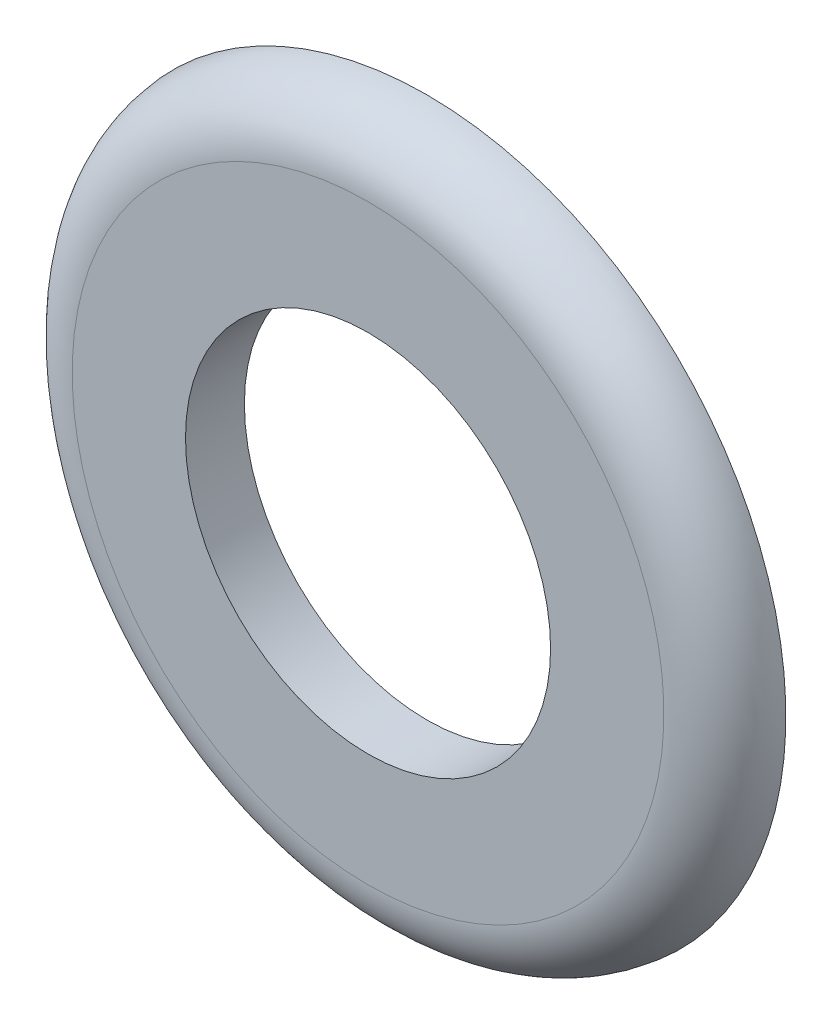
ISO-10303-21;
HEADER;
FILE_DESCRIPTION(('STEP AP214'),'2;1');
FILE_NAME('part.step','',(''),(''),'','','');
FILE_SCHEMA(('AUTOMOTIVE_DESIGN { 1 0 10303 214 1 1 1 1 }'));
ENDSEC;
DATA;
#1=APPLICATION_CONTEXT('core data for automotive mechanical design processes');
#2=APPLICATION_PROTOCOL_DEFINITION('international standard','automotive_design',2000,#1);
#3=PRODUCT_CONTEXT('',#1,'mechanical');
#4=PRODUCT('Part','Part','',(#3));
#5=PRODUCT_RELATED_PRODUCT_CATEGORY('part','',(#4));
#6=PRODUCT_DEFINITION_FORMATION('','',#4);
#7=PRODUCT_DEFINITION_CONTEXT('part definition',#1,'design');
#8=PRODUCT_DEFINITION('design','',#6,#7);
#9=PRODUCT_DEFINITION_SHAPE('','',#8);
#10=(LENGTH_UNIT() NAMED_UNIT(*) SI_UNIT(.MILLI.,.METRE.));
#11=(NAMED_UNIT(*) PLANE_ANGLE_UNIT() SI_UNIT($,.RADIAN.));
#12=(NAMED_UNIT(*) SI_UNIT($,.STERADIAN.) SOLID_ANGLE_UNIT());
#13=UNCERTAINTY_MEASURE_WITH_UNIT(LENGTH_MEASURE(1.E-05),#10,'distance_accuracy_value','');
#14=(GEOMETRIC_REPRESENTATION_CONTEXT(3) GLOBAL_UNCERTAINTY_ASSIGNED_CONTEXT((#13)) GLOBAL_UNIT_ASSIGNED_CONTEXT((#10,
#11,#12)) REPRESENTATION_CONTEXT('',''));
#15=CARTESIAN_POINT('',(0.,0.,0.));
#16=DIRECTION('',(0.,0.,1.));
#17=DIRECTION('',(1.,0.,0.));
#18=AXIS2_PLACEMENT_3D('',#15,#16,#17);
#19=CARTESIAN_POINT('',(0.,5.16666666666666,7.7714));
#20=DIRECTION('',(0.,0.,1.));
#21=DIRECTION('',(0.,-1.,0.));
#22=AXIS2_PLACEMENT_3D('',#19,#20,#21);
#23=PLANE('',#22);
#24=CARTESIAN_POINT('',(0.,0.,7.7714));
#25=DIRECTION('',(0.,0.,-1.));
#26=DIRECTION('',(0.,1.,0.));
#27=AXIS2_PLACEMENT_3D('',#24,#25,#26);
#28=CIRCLE('',#27,3.18810118395209);
#29=CARTESIAN_POINT('',(0.,3.18810118395209,7.7714));
#30=VERTEX_POINT('',#29);
#31=EDGE_CURVE('E20',#30,#30,#28,.T.);
#32=ORIENTED_EDGE('',*,*,#31,.T.);
#33=EDGE_LOOP('',(#32));
#34=FACE_BOUND('',#33,.T.);
#35=CARTESIAN_POINT('',(0.,0.,7.7714));
#36=DIRECTION('',(0.,0.,-1.));
#37=DIRECTION('',(0.,1.,0.));
#38=AXIS2_PLACEMENT_3D('',#35,#36,#37);
#39=CIRCLE('',#38,5.16666666666666);
#40=CARTESIAN_POINT('',(0.,5.16666666666666,7.7714));
#41=VERTEX_POINT('',#40);
#42=CARTESIAN_POINT('',(0.,-5.16666666666667,7.7714));
#43=VERTEX_POINT('',#42);
#44=EDGE_CURVE('E32',#41,#43,#39,.T.);
#45=ORIENTED_EDGE('',*,*,#44,.F.);
#46=CARTESIAN_POINT('',(0.,0.,7.7714));
#47=DIRECTION('',(0.,0.,-1.));
#48=DIRECTION('',(0.,-1.,0.));
#49=AXIS2_PLACEMENT_3D('',#46,#47,#48);
#50=CIRCLE('',#49,5.16666666666667);
#51=EDGE_CURVE('E35',#43,#41,#50,.T.);
#52=ORIENTED_EDGE('',*,*,#51,.F.);
#53=EDGE_LOOP('',(#45,#52));
#54=FACE_BOUND('',#53,.T.);
#55=ADVANCED_FACE('F16',(#34,#54),#23,.T.);
#56=CARTESIAN_POINT('',(0.,0.,6.66666666666667));
#57=DIRECTION('',(0.,0.,-1.));
#58=DIRECTION('',(0.,1.,0.));
#59=AXIS2_PLACEMENT_3D('',#56,#57,#58);
#60=TOROIDAL_SURFACE('',#59,5.16666666666667,1.10473333333333);
#61=ORIENTED_EDGE('',*,*,#44,.T.);
#62=ORIENTED_EDGE('',*,*,#51,.T.);
#63=EDGE_LOOP('',(#61,#62));
#64=FACE_BOUND('',#63,.T.);
#65=CARTESIAN_POINT('',(0.,0.,6.74286666666667));
#66=DIRECTION('',(0.,0.,-1.));
#67=DIRECTION('',(0.,1.,0.));
#68=AXIS2_PLACEMENT_3D('',#65,#66,#67);
#69=CIRCLE('',#68,6.26876888414823);
#70=CARTESIAN_POINT('',(0.,6.26876888414823,6.74286666666667));
#71=VERTEX_POINT('',#70);
#72=EDGE_CURVE('E26',#71,#71,#69,.T.);
#73=ORIENTED_EDGE('',*,*,#72,.F.);
#74=EDGE_LOOP('',(#73));
#75=FACE_BOUND('',#74,.T.);
#76=ADVANCED_FACE('F42',(#64,#75),#60,.T.);
#77=CARTESIAN_POINT('',(0.,0.,6.74286666666667));
#78=DIRECTION('',(0.,0.,-1.));
#79=DIRECTION('',(0.,1.,0.));
#80=AXIS2_PLACEMENT_3D('',#77,#78,#79);
#81=CYLINDRICAL_SURFACE('',#80,3.18810118395209);
#82=CARTESIAN_POINT('',(0.,0.,6.74286666666667));
#83=DIRECTION('',(0.,0.,-1.));
#84=DIRECTION('',(0.,1.,0.));
#85=AXIS2_PLACEMENT_3D('',#82,#83,#84);
#86=CIRCLE('',#85,3.18810118395209);
#87=CARTESIAN_POINT('',(0.,3.18810118395209,6.74286666666667));
#88=VERTEX_POINT('',#87);
#89=EDGE_CURVE('E11',#88,#88,#86,.F.);
#90=ORIENTED_EDGE('',*,*,#89,.F.);
#91=EDGE_LOOP('',(#90));
#92=FACE_BOUND('',#91,.T.);
#93=ORIENTED_EDGE('',*,*,#31,.F.);
#94=EDGE_LOOP('',(#93));
#95=FACE_BOUND('',#94,.T.);
#96=ADVANCED_FACE('F59',(#92,#95),#81,.F.);
#97=CARTESIAN_POINT('',(0.,3.18810118395208,6.74286666666667));
#98=DIRECTION('',(0.,0.,-1.));
#99=DIRECTION('',(0.,1.,0.));
#100=AXIS2_PLACEMENT_3D('',#97,#98,#99);
#101=PLANE('',#100);
#102=ORIENTED_EDGE('',*,*,#89,.T.);
#103=EDGE_LOOP('',(#102));
#104=FACE_BOUND('',#103,.T.);
#105=ORIENTED_EDGE('',*,*,#72,.T.);
#106=EDGE_LOOP('',(#105));
#107=FACE_BOUND('',#106,.T.);
#108=ADVANCED_FACE('F85',(#104,#107),#101,.T.);
#109=CLOSED_SHELL('',(#55,#76,#96,#108));
#110=MANIFOLD_SOLID_BREP('B1',#109);
#111=ADVANCED_BREP_SHAPE_REPRESENTATION('',(#18,#110),#14);
#112=SHAPE_DEFINITION_REPRESENTATION(#9,#111);
ENDSEC;
END-ISO-10303-21;
